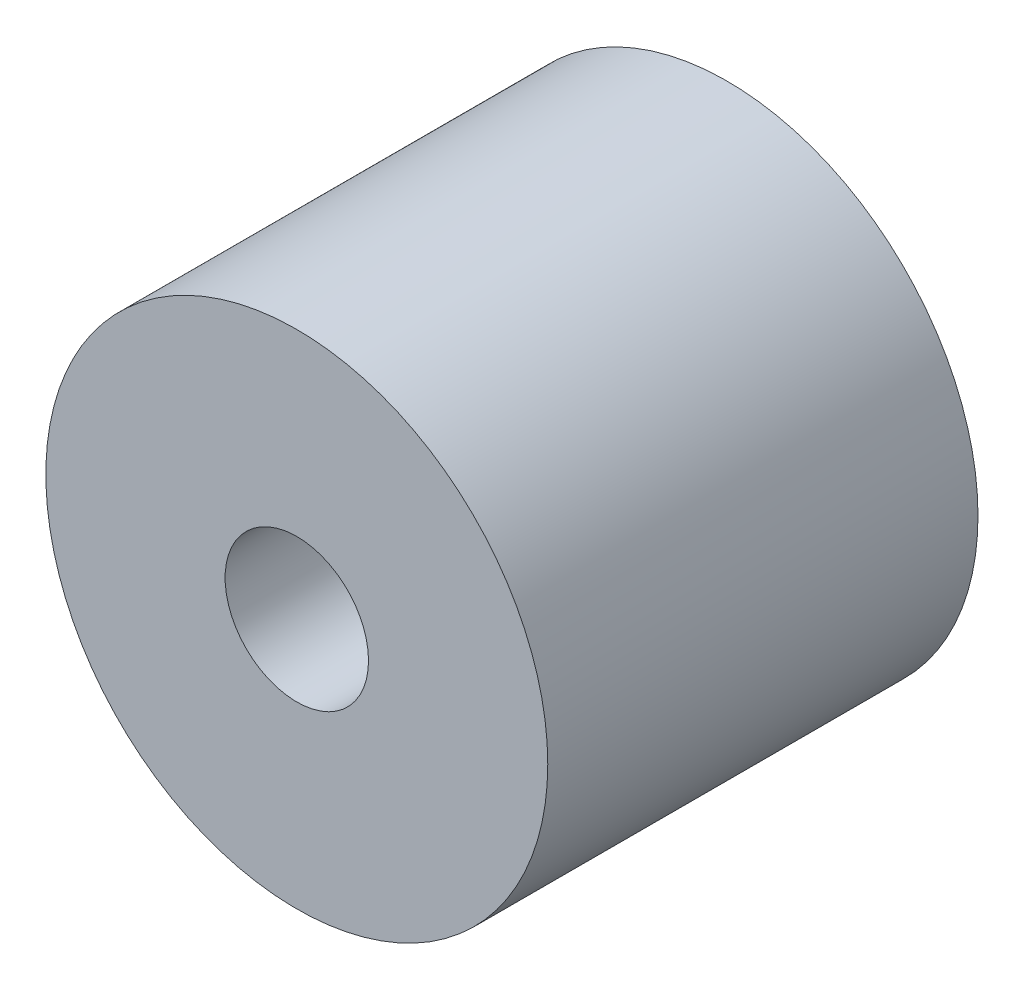
ISO-10303-21;
HEADER;
FILE_DESCRIPTION(('STEP AP214'),'2;1');
FILE_NAME('part.step','',(''),(''),'','','');
FILE_SCHEMA(('AUTOMOTIVE_DESIGN { 1 0 10303 214 1 1 1 1 }'));
ENDSEC;
DATA;
#1=APPLICATION_CONTEXT('core data for automotive mechanical design processes');
#2=APPLICATION_PROTOCOL_DEFINITION('international standard','automotive_design',2000,#1);
#3=PRODUCT_CONTEXT('',#1,'mechanical');
#4=PRODUCT('Part','Part','',(#3));
#5=PRODUCT_RELATED_PRODUCT_CATEGORY('part','',(#4));
#6=PRODUCT_DEFINITION_FORMATION('','',#4);
#7=PRODUCT_DEFINITION_CONTEXT('part definition',#1,'design');
#8=PRODUCT_DEFINITION('design','',#6,#7);
#9=PRODUCT_DEFINITION_SHAPE('','',#8);
#10=(LENGTH_UNIT() NAMED_UNIT(*) SI_UNIT(.MILLI.,.METRE.));
#11=(NAMED_UNIT(*) PLANE_ANGLE_UNIT() SI_UNIT($,.RADIAN.));
#12=(NAMED_UNIT(*) SI_UNIT($,.STERADIAN.) SOLID_ANGLE_UNIT());
#13=UNCERTAINTY_MEASURE_WITH_UNIT(LENGTH_MEASURE(1.E-05),#10,'distance_accuracy_value','');
#14=(GEOMETRIC_REPRESENTATION_CONTEXT(3) GLOBAL_UNCERTAINTY_ASSIGNED_CONTEXT((#13)) GLOBAL_UNIT_ASSIGNED_CONTEXT((#10,
#11,#12)) REPRESENTATION_CONTEXT('',''));
#15=CARTESIAN_POINT('',(0.,0.,0.));
#16=DIRECTION('',(0.,0.,1.));
#17=DIRECTION('',(1.,0.,0.));
#18=AXIS2_PLACEMENT_3D('',#15,#16,#17);
#19=CARTESIAN_POINT('',(0.,0.,15.));
#20=DIRECTION('',(0.,0.,1.));
#21=DIRECTION('',(1.,0.,0.));
#22=AXIS2_PLACEMENT_3D('',#19,#20,#21);
#23=PLANE('',#22);
#24=CARTESIAN_POINT('',(0.,0.,15.));
#25=DIRECTION('',(0.,0.,1.));
#26=DIRECTION('',(1.,0.,0.));
#27=AXIS2_PLACEMENT_3D('',#24,#25,#26);
#28=CIRCLE('',#27,17.5);
#29=CARTESIAN_POINT('',(17.5,0.,15.));
#30=VERTEX_POINT('',#29);
#31=EDGE_CURVE('E10',#30,#30,#28,.T.);
#32=ORIENTED_EDGE('',*,*,#31,.T.);
#33=EDGE_LOOP('',(#32));
#34=FACE_BOUND('',#33,.T.);
#35=CARTESIAN_POINT('',(0.,0.,15.));
#36=DIRECTION('',(0.,0.,1.));
#37=DIRECTION('',(1.,0.,0.));
#38=AXIS2_PLACEMENT_3D('',#35,#36,#37);
#39=CIRCLE('',#38,5.);
#40=CARTESIAN_POINT('',(5.,0.,15.));
#41=VERTEX_POINT('',#40);
#42=EDGE_CURVE('E50',#41,#41,#39,.T.);
#43=ORIENTED_EDGE('',*,*,#42,.F.);
#44=EDGE_LOOP('',(#43));
#45=FACE_BOUND('',#44,.T.);
#46=ADVANCED_FACE('F37',(#34,#45),#23,.T.);
#47=CARTESIAN_POINT('',(0.,0.,-15.));
#48=DIRECTION('',(0.,0.,1.));
#49=DIRECTION('',(1.,0.,0.));
#50=AXIS2_PLACEMENT_3D('',#47,#48,#49);
#51=PLANE('',#50);
#52=CARTESIAN_POINT('',(0.,0.,-15.));
#53=DIRECTION('',(0.,0.,1.));
#54=DIRECTION('',(1.,0.,0.));
#55=AXIS2_PLACEMENT_3D('',#52,#53,#54);
#56=CIRCLE('',#55,17.5);
#57=CARTESIAN_POINT('',(17.5,0.,-15.));
#58=VERTEX_POINT('',#57);
#59=EDGE_CURVE('E41',#58,#58,#56,.T.);
#60=ORIENTED_EDGE('',*,*,#59,.F.);
#61=EDGE_LOOP('',(#60));
#62=FACE_BOUND('',#61,.T.);
#63=CARTESIAN_POINT('',(0.,0.,-15.));
#64=DIRECTION('',(0.,0.,1.));
#65=DIRECTION('',(1.,0.,0.));
#66=AXIS2_PLACEMENT_3D('',#63,#64,#65);
#67=CIRCLE('',#66,5.);
#68=CARTESIAN_POINT('',(5.,0.,-15.));
#69=VERTEX_POINT('',#68);
#70=EDGE_CURVE('E52',#69,#69,#67,.T.);
#71=ORIENTED_EDGE('',*,*,#70,.T.);
#72=EDGE_LOOP('',(#71));
#73=FACE_BOUND('',#72,.T.);
#74=ADVANCED_FACE('F64',(#62,#73),#51,.F.);
#75=CARTESIAN_POINT('',(0.,0.,15.));
#76=DIRECTION('',(0.,0.,-1.));
#77=DIRECTION('',(-1.,0.,0.));
#78=AXIS2_PLACEMENT_3D('',#75,#76,#77);
#79=CYLINDRICAL_SURFACE('',#78,17.5);
#80=ORIENTED_EDGE('',*,*,#31,.F.);
#81=EDGE_LOOP('',(#80));
#82=FACE_BOUND('',#81,.T.);
#83=ORIENTED_EDGE('',*,*,#59,.T.);
#84=EDGE_LOOP('',(#83));
#85=FACE_BOUND('',#84,.T.);
#86=ADVANCED_FACE('F39',(#82,#85),#79,.T.);
#87=CARTESIAN_POINT('',(0.,0.,15.));
#88=DIRECTION('',(0.,0.,-1.));
#89=DIRECTION('',(-1.,0.,0.));
#90=AXIS2_PLACEMENT_3D('',#87,#88,#89);
#91=CYLINDRICAL_SURFACE('',#90,5.);
#92=ORIENTED_EDGE('',*,*,#42,.T.);
#93=EDGE_LOOP('',(#92));
#94=FACE_BOUND('',#93,.T.);
#95=ORIENTED_EDGE('',*,*,#70,.F.);
#96=EDGE_LOOP('',(#95));
#97=FACE_BOUND('',#96,.T.);
#98=ADVANCED_FACE('F60',(#94,#97),#91,.F.);
#99=CLOSED_SHELL('',(#46,#74,#86,#98));
#100=MANIFOLD_SOLID_BREP('B2',#99);
#101=ADVANCED_BREP_SHAPE_REPRESENTATION('',(#18,#100),#14);
#102=SHAPE_DEFINITION_REPRESENTATION(#9,#101);
ENDSEC;
END-ISO-10303-21;
